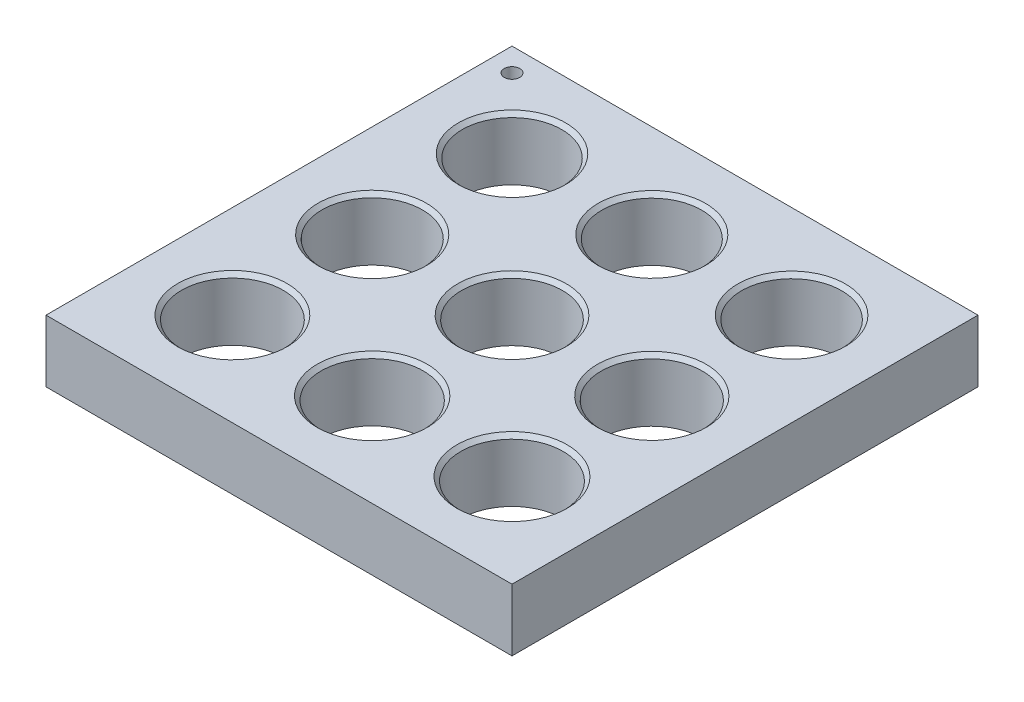
ISO-10303-21;
HEADER;
FILE_DESCRIPTION(('STEP AP214'),'2;1');
FILE_NAME('part.step','',(''),(''),'','','');
FILE_SCHEMA(('AUTOMOTIVE_DESIGN { 1 0 10303 214 1 1 1 1 }'));
ENDSEC;
DATA;
#1=APPLICATION_CONTEXT('core data for automotive mechanical design processes');
#2=APPLICATION_PROTOCOL_DEFINITION('international standard','automotive_design',2000,#1);
#3=PRODUCT_CONTEXT('',#1,'mechanical');
#4=PRODUCT('Part','Part','',(#3));
#5=PRODUCT_RELATED_PRODUCT_CATEGORY('part','',(#4));
#6=PRODUCT_DEFINITION_FORMATION('','',#4);
#7=PRODUCT_DEFINITION_CONTEXT('part definition',#1,'design');
#8=PRODUCT_DEFINITION('design','',#6,#7);
#9=PRODUCT_DEFINITION_SHAPE('','',#8);
#10=(LENGTH_UNIT() NAMED_UNIT(*) SI_UNIT(.MILLI.,.METRE.));
#11=(NAMED_UNIT(*) PLANE_ANGLE_UNIT() SI_UNIT($,.RADIAN.));
#12=(NAMED_UNIT(*) SI_UNIT($,.STERADIAN.) SOLID_ANGLE_UNIT());
#13=UNCERTAINTY_MEASURE_WITH_UNIT(LENGTH_MEASURE(1.E-05),#10,'distance_accuracy_value','');
#14=(GEOMETRIC_REPRESENTATION_CONTEXT(3) GLOBAL_UNCERTAINTY_ASSIGNED_CONTEXT((#13)) GLOBAL_UNIT_ASSIGNED_CONTEXT((#10,
#11,#12)) REPRESENTATION_CONTEXT('',''));
#15=CARTESIAN_POINT('',(0.,0.,0.));
#16=DIRECTION('',(0.,0.,1.));
#17=DIRECTION('',(1.,0.,0.));
#18=AXIS2_PLACEMENT_3D('',#15,#16,#17);
#19=CARTESIAN_POINT('',(30.,8.,-30.));
#20=DIRECTION('',(-1.,0.,0.));
#21=DIRECTION('',(0.,0.,1.));
#22=AXIS2_PLACEMENT_3D('',#19,#20,#21);
#23=PLANE('',#22);
#24=DIRECTION('',(0.,0.,-1.));
#25=VECTOR('',#24,1.);
#26=CARTESIAN_POINT('',(30.,0.,-30.));
#27=LINE('',#26,#25);
#28=CARTESIAN_POINT('',(30.,0.,30.));
#29=VERTEX_POINT('',#28);
#30=CARTESIAN_POINT('',(30.,0.,-30.));
#31=VERTEX_POINT('',#30);
#32=EDGE_CURVE('E122',#29,#31,#27,.T.);
#33=ORIENTED_EDGE('',*,*,#32,.T.);
#34=DIRECTION('',(0.,-1.,0.));
#35=VECTOR('',#34,1.);
#36=CARTESIAN_POINT('',(30.,8.,-30.));
#37=LINE('',#36,#35);
#38=CARTESIAN_POINT('',(30.,8.,-30.));
#39=VERTEX_POINT('',#38);
#40=EDGE_CURVE('E111',#39,#31,#37,.T.);
#41=ORIENTED_EDGE('',*,*,#40,.F.);
#42=DIRECTION('',(0.,0.,-1.));
#43=VECTOR('',#42,1.);
#44=CARTESIAN_POINT('',(30.,8.,-30.));
#45=LINE('',#44,#43);
#46=CARTESIAN_POINT('',(30.,8.,30.));
#47=VERTEX_POINT('',#46);
#48=EDGE_CURVE('E103',#47,#39,#45,.T.);
#49=ORIENTED_EDGE('',*,*,#48,.F.);
#50=DIRECTION('',(0.,-1.,0.));
#51=VECTOR('',#50,1.);
#52=CARTESIAN_POINT('',(30.,8.,30.));
#53=LINE('',#52,#51);
#54=EDGE_CURVE('E118',#47,#29,#53,.T.);
#55=ORIENTED_EDGE('',*,*,#54,.T.);
#56=EDGE_LOOP('',(#33,#41,#49,#55));
#57=FACE_BOUND('',#56,.T.);
#58=ADVANCED_FACE('F47',(#57),#23,.F.);
#59=CARTESIAN_POINT('',(-30.,8.,-30.));
#60=DIRECTION('',(0.,0.,1.));
#61=DIRECTION('',(1.,0.,0.));
#62=AXIS2_PLACEMENT_3D('',#59,#60,#61);
#63=PLANE('',#62);
#64=DIRECTION('',(-1.,0.,0.));
#65=VECTOR('',#64,1.);
#66=CARTESIAN_POINT('',(-30.,0.,-30.));
#67=LINE('',#66,#65);
#68=CARTESIAN_POINT('',(-30.,0.,-30.));
#69=VERTEX_POINT('',#68);
#70=EDGE_CURVE('E109',#31,#69,#67,.T.);
#71=ORIENTED_EDGE('',*,*,#70,.T.);
#72=DIRECTION('',(0.,-1.,0.));
#73=VECTOR('',#72,1.);
#74=CARTESIAN_POINT('',(-30.,8.,-30.));
#75=LINE('',#74,#73);
#76=CARTESIAN_POINT('',(-30.,8.,-30.));
#77=VERTEX_POINT('',#76);
#78=EDGE_CURVE('E107',#77,#69,#75,.T.);
#79=ORIENTED_EDGE('',*,*,#78,.F.);
#80=DIRECTION('',(-1.,0.,0.));
#81=VECTOR('',#80,1.);
#82=CARTESIAN_POINT('',(-30.,8.,-30.));
#83=LINE('',#82,#81);
#84=EDGE_CURVE('E98',#39,#77,#83,.T.);
#85=ORIENTED_EDGE('',*,*,#84,.F.);
#86=ORIENTED_EDGE('',*,*,#40,.T.);
#87=EDGE_LOOP('',(#71,#79,#85,#86));
#88=FACE_BOUND('',#87,.T.);
#89=ADVANCED_FACE('F108',(#88),#63,.F.);
#90=CARTESIAN_POINT('',(-30.,8.,-30.));
#91=DIRECTION('',(1.,0.,0.));
#92=DIRECTION('',(0.,0.,-1.));
#93=AXIS2_PLACEMENT_3D('',#90,#91,#92);
#94=PLANE('',#93);
#95=DIRECTION('',(0.,0.,1.));
#96=VECTOR('',#95,1.);
#97=CARTESIAN_POINT('',(-30.,0.,-30.));
#98=LINE('',#97,#96);
#99=CARTESIAN_POINT('',(-30.,0.,30.));
#100=VERTEX_POINT('',#99);
#101=EDGE_CURVE('E84',#69,#100,#98,.T.);
#102=ORIENTED_EDGE('',*,*,#101,.T.);
#103=DIRECTION('',(0.,-1.,0.));
#104=VECTOR('',#103,1.);
#105=CARTESIAN_POINT('',(-30.,8.,30.));
#106=LINE('',#105,#104);
#107=CARTESIAN_POINT('',(-30.,8.,30.));
#108=VERTEX_POINT('',#107);
#109=EDGE_CURVE('E112',#108,#100,#106,.T.);
#110=ORIENTED_EDGE('',*,*,#109,.F.);
#111=DIRECTION('',(0.,0.,1.));
#112=VECTOR('',#111,1.);
#113=CARTESIAN_POINT('',(-30.,8.,-30.));
#114=LINE('',#113,#112);
#115=EDGE_CURVE('E101',#77,#108,#114,.T.);
#116=ORIENTED_EDGE('',*,*,#115,.F.);
#117=ORIENTED_EDGE('',*,*,#78,.T.);
#118=EDGE_LOOP('',(#102,#110,#116,#117));
#119=FACE_BOUND('',#118,.T.);
#120=ADVANCED_FACE('F114',(#119),#94,.F.);
#121=CARTESIAN_POINT('',(-30.,8.,30.));
#122=DIRECTION('',(0.,0.,-1.));
#123=DIRECTION('',(-1.,0.,0.));
#124=AXIS2_PLACEMENT_3D('',#121,#122,#123);
#125=PLANE('',#124);
#126=DIRECTION('',(1.,0.,0.));
#127=VECTOR('',#126,1.);
#128=CARTESIAN_POINT('',(-30.,0.,30.));
#129=LINE('',#128,#127);
#130=EDGE_CURVE('E90',#100,#29,#129,.T.);
#131=ORIENTED_EDGE('',*,*,#130,.T.);
#132=ORIENTED_EDGE('',*,*,#54,.F.);
#133=DIRECTION('',(1.,0.,0.));
#134=VECTOR('',#133,1.);
#135=CARTESIAN_POINT('',(-30.,8.,30.));
#136=LINE('',#135,#134);
#137=EDGE_CURVE('E67',#108,#47,#136,.T.);
#138=ORIENTED_EDGE('',*,*,#137,.F.);
#139=ORIENTED_EDGE('',*,*,#109,.T.);
#140=EDGE_LOOP('',(#131,#132,#138,#139));
#141=FACE_BOUND('',#140,.T.);
#142=ADVANCED_FACE('F385',(#141),#125,.F.);
#143=CARTESIAN_POINT('',(0.,8.,0.));
#144=DIRECTION('',(0.,1.,0.));
#145=DIRECTION('',(0.,0.,1.));
#146=AXIS2_PLACEMENT_3D('',#143,#144,#145);
#147=PLANE('',#146);
#148=CARTESIAN_POINT('',(-27.,8.,-27.));
#149=DIRECTION('',(0.,1.,0.));
#150=DIRECTION('',(0.,0.,1.));
#151=AXIS2_PLACEMENT_3D('',#148,#149,#150);
#152=CIRCLE('',#151,1.);
#153=CARTESIAN_POINT('',(-27.,8.,-26.));
#154=VERTEX_POINT('',#153);
#155=EDGE_CURVE('E52',#154,#154,#152,.F.);
#156=ORIENTED_EDGE('',*,*,#155,.T.);
#157=EDGE_LOOP('',(#156));
#158=FACE_BOUND('',#157,.T.);
#159=CARTESIAN_POINT('',(18.,8.,18.));
#160=DIRECTION('',(0.,1.,0.));
#161=DIRECTION('',(0.,0.,1.));
#162=AXIS2_PLACEMENT_3D('',#159,#160,#161);
#163=CIRCLE('',#162,7.10000000000002);
#164=CARTESIAN_POINT('',(18.,8.,25.1));
#165=VERTEX_POINT('',#164);
#166=EDGE_CURVE('E175',#165,#165,#163,.F.);
#167=ORIENTED_EDGE('',*,*,#166,.T.);
#168=EDGE_LOOP('',(#167));
#169=FACE_BOUND('',#168,.T.);
#170=CARTESIAN_POINT('',(0.,8.,18.));
#171=DIRECTION('',(0.,1.,0.));
#172=DIRECTION('',(0.,0.,1.));
#173=AXIS2_PLACEMENT_3D('',#170,#171,#172);
#174=CIRCLE('',#173,7.075);
#175=CARTESIAN_POINT('',(0.,8.,25.075));
#176=VERTEX_POINT('',#175);
#177=EDGE_CURVE('E171',#176,#176,#174,.F.);
#178=ORIENTED_EDGE('',*,*,#177,.T.);
#179=EDGE_LOOP('',(#178));
#180=FACE_BOUND('',#179,.T.);
#181=CARTESIAN_POINT('',(-18.,8.,18.));
#182=DIRECTION('',(0.,1.,0.));
#183=DIRECTION('',(0.,0.,1.));
#184=AXIS2_PLACEMENT_3D('',#181,#182,#183);
#185=CIRCLE('',#184,7.05000000000002);
#186=CARTESIAN_POINT('',(-18.,8.,25.05));
#187=VERTEX_POINT('',#186);
#188=EDGE_CURVE('E167',#187,#187,#185,.F.);
#189=ORIENTED_EDGE('',*,*,#188,.T.);
#190=EDGE_LOOP('',(#189));
#191=FACE_BOUND('',#190,.T.);
#192=CARTESIAN_POINT('',(-18.,8.,0.));
#193=DIRECTION('',(0.,1.,0.));
#194=DIRECTION('',(0.,0.,1.));
#195=AXIS2_PLACEMENT_3D('',#192,#193,#194);
#196=CIRCLE('',#195,6.97500000000002);
#197=CARTESIAN_POINT('',(-18.,8.,6.97500000000002));
#198=VERTEX_POINT('',#197);
#199=EDGE_CURVE('E163',#198,#198,#196,.F.);
#200=ORIENTED_EDGE('',*,*,#199,.T.);
#201=EDGE_LOOP('',(#200));
#202=FACE_BOUND('',#201,.T.);
#203=CARTESIAN_POINT('',(18.,8.,0.));
#204=DIRECTION('',(0.,1.,0.));
#205=DIRECTION('',(0.,0.,1.));
#206=AXIS2_PLACEMENT_3D('',#203,#204,#205);
#207=CIRCLE('',#206,7.02500000000001);
#208=CARTESIAN_POINT('',(18.,8.,7.02500000000001));
#209=VERTEX_POINT('',#208);
#210=EDGE_CURVE('E159',#209,#209,#207,.F.);
#211=ORIENTED_EDGE('',*,*,#210,.T.);
#212=EDGE_LOOP('',(#211));
#213=FACE_BOUND('',#212,.T.);
#214=CARTESIAN_POINT('',(0.,8.,0.));
#215=DIRECTION('',(0.,1.,0.));
#216=DIRECTION('',(0.,0.,1.));
#217=AXIS2_PLACEMENT_3D('',#214,#215,#216);
#218=CIRCLE('',#217,7.);
#219=CARTESIAN_POINT('',(0.,8.,7.));
#220=VERTEX_POINT('',#219);
#221=EDGE_CURVE('E155',#220,#220,#218,.F.);
#222=ORIENTED_EDGE('',*,*,#221,.T.);
#223=EDGE_LOOP('',(#222));
#224=FACE_BOUND('',#223,.T.);
#225=CARTESIAN_POINT('',(18.,8.,-18.));
#226=DIRECTION('',(0.,1.,0.));
#227=DIRECTION('',(0.,0.,1.));
#228=AXIS2_PLACEMENT_3D('',#225,#226,#227);
#229=CIRCLE('',#228,6.95);
#230=CARTESIAN_POINT('',(18.,8.,-11.05));
#231=VERTEX_POINT('',#230);
#232=EDGE_CURVE('E151',#231,#231,#229,.F.);
#233=ORIENTED_EDGE('',*,*,#232,.T.);
#234=EDGE_LOOP('',(#233));
#235=FACE_BOUND('',#234,.T.);
#236=CARTESIAN_POINT('',(0.,8.,-18.));
#237=DIRECTION('',(0.,1.,0.));
#238=DIRECTION('',(0.,0.,1.));
#239=AXIS2_PLACEMENT_3D('',#236,#237,#238);
#240=CIRCLE('',#239,6.925);
#241=CARTESIAN_POINT('',(0.,8.,-11.075));
#242=VERTEX_POINT('',#241);
#243=EDGE_CURVE('E147',#242,#242,#240,.F.);
#244=ORIENTED_EDGE('',*,*,#243,.T.);
#245=EDGE_LOOP('',(#244));
#246=FACE_BOUND('',#245,.T.);
#247=CARTESIAN_POINT('',(-18.,8.,-18.));
#248=DIRECTION('',(0.,1.,0.));
#249=DIRECTION('',(0.,0.,1.));
#250=AXIS2_PLACEMENT_3D('',#247,#248,#249);
#251=CIRCLE('',#250,6.9);
#252=CARTESIAN_POINT('',(-18.,8.,-11.1));
#253=VERTEX_POINT('',#252);
#254=EDGE_CURVE('E143',#253,#253,#251,.F.);
#255=ORIENTED_EDGE('',*,*,#254,.T.);
#256=EDGE_LOOP('',(#255));
#257=FACE_BOUND('',#256,.T.);
#258=ORIENTED_EDGE('',*,*,#48,.T.);
#259=ORIENTED_EDGE('',*,*,#84,.T.);
#260=ORIENTED_EDGE('',*,*,#115,.T.);
#261=ORIENTED_EDGE('',*,*,#137,.T.);
#262=EDGE_LOOP('',(#258,#259,#260,#261));
#263=FACE_BOUND('',#262,.T.);
#264=ADVANCED_FACE('F99',(#158,#169,#180,#191,#202,#213,#224,#235,#246,#257,#263),#147,.T.);
#265=CARTESIAN_POINT('',(0.,0.,0.));
#266=DIRECTION('',(0.,1.,0.));
#267=DIRECTION('',(0.,0.,1.));
#268=AXIS2_PLACEMENT_3D('',#265,#266,#267);
#269=PLANE('',#268);
#270=CARTESIAN_POINT('',(0.,0.,-18.));
#271=DIRECTION('',(0.,1.,0.));
#272=DIRECTION('',(0.,0.,1.));
#273=AXIS2_PLACEMENT_3D('',#270,#271,#272);
#274=CIRCLE('',#273,6.425);
#275=CARTESIAN_POINT('',(0.,0.,-11.575));
#276=VERTEX_POINT('',#275);
#277=EDGE_CURVE('E313',#276,#276,#274,.T.);
#278=ORIENTED_EDGE('',*,*,#277,.T.);
#279=EDGE_LOOP('',(#278));
#280=FACE_BOUND('',#279,.T.);
#281=CARTESIAN_POINT('',(18.,0.,-18.));
#282=DIRECTION('',(0.,1.,0.));
#283=DIRECTION('',(0.,0.,1.));
#284=AXIS2_PLACEMENT_3D('',#281,#282,#283);
#285=CIRCLE('',#284,6.45);
#286=CARTESIAN_POINT('',(18.,0.,-11.55));
#287=VERTEX_POINT('',#286);
#288=EDGE_CURVE('E304',#287,#287,#285,.T.);
#289=ORIENTED_EDGE('',*,*,#288,.T.);
#290=EDGE_LOOP('',(#289));
#291=FACE_BOUND('',#290,.T.);
#292=CARTESIAN_POINT('',(-18.,0.,0.));
#293=DIRECTION('',(0.,1.,0.));
#294=DIRECTION('',(0.,0.,1.));
#295=AXIS2_PLACEMENT_3D('',#292,#293,#294);
#296=CIRCLE('',#295,6.475);
#297=CARTESIAN_POINT('',(-18.,0.,6.475));
#298=VERTEX_POINT('',#297);
#299=EDGE_CURVE('E298',#298,#298,#296,.T.);
#300=ORIENTED_EDGE('',*,*,#299,.T.);
#301=EDGE_LOOP('',(#300));
#302=FACE_BOUND('',#301,.T.);
#303=CARTESIAN_POINT('',(0.,0.,0.));
#304=DIRECTION('',(0.,1.,0.));
#305=DIRECTION('',(0.,0.,1.));
#306=AXIS2_PLACEMENT_3D('',#303,#304,#305);
#307=CIRCLE('',#306,6.5);
#308=CARTESIAN_POINT('',(0.,0.,6.5));
#309=VERTEX_POINT('',#308);
#310=EDGE_CURVE('E295',#309,#309,#307,.T.);
#311=ORIENTED_EDGE('',*,*,#310,.T.);
#312=EDGE_LOOP('',(#311));
#313=FACE_BOUND('',#312,.T.);
#314=CARTESIAN_POINT('',(-18.,0.,18.));
#315=DIRECTION('',(0.,1.,0.));
#316=DIRECTION('',(0.,0.,1.));
#317=AXIS2_PLACEMENT_3D('',#314,#315,#316);
#318=CIRCLE('',#317,6.55);
#319=CARTESIAN_POINT('',(-18.,0.,24.55));
#320=VERTEX_POINT('',#319);
#321=EDGE_CURVE('E327',#320,#320,#318,.T.);
#322=ORIENTED_EDGE('',*,*,#321,.T.);
#323=EDGE_LOOP('',(#322));
#324=FACE_BOUND('',#323,.T.);
#325=CARTESIAN_POINT('',(18.,0.,18.));
#326=DIRECTION('',(0.,1.,0.));
#327=DIRECTION('',(0.,0.,1.));
#328=AXIS2_PLACEMENT_3D('',#325,#326,#327);
#329=CIRCLE('',#328,6.60000000000001);
#330=CARTESIAN_POINT('',(18.,0.,24.6));
#331=VERTEX_POINT('',#330);
#332=EDGE_CURVE('E325',#331,#331,#329,.T.);
#333=ORIENTED_EDGE('',*,*,#332,.T.);
#334=EDGE_LOOP('',(#333));
#335=FACE_BOUND('',#334,.T.);
#336=CARTESIAN_POINT('',(0.,0.,18.));
#337=DIRECTION('',(0.,1.,0.));
#338=DIRECTION('',(0.,0.,1.));
#339=AXIS2_PLACEMENT_3D('',#336,#337,#338);
#340=CIRCLE('',#339,6.575);
#341=CARTESIAN_POINT('',(0.,0.,24.575));
#342=VERTEX_POINT('',#341);
#343=EDGE_CURVE('E307',#342,#342,#340,.T.);
#344=ORIENTED_EDGE('',*,*,#343,.T.);
#345=EDGE_LOOP('',(#344));
#346=FACE_BOUND('',#345,.T.);
#347=CARTESIAN_POINT('',(18.,0.,0.));
#348=DIRECTION('',(0.,1.,0.));
#349=DIRECTION('',(0.,0.,1.));
#350=AXIS2_PLACEMENT_3D('',#347,#348,#349);
#351=CIRCLE('',#350,6.525);
#352=CARTESIAN_POINT('',(18.,0.,6.525));
#353=VERTEX_POINT('',#352);
#354=EDGE_CURVE('E299',#353,#353,#351,.T.);
#355=ORIENTED_EDGE('',*,*,#354,.T.);
#356=EDGE_LOOP('',(#355));
#357=FACE_BOUND('',#356,.T.);
#358=CARTESIAN_POINT('',(-18.,0.,-18.));
#359=DIRECTION('',(0.,1.,0.));
#360=DIRECTION('',(0.,0.,1.));
#361=AXIS2_PLACEMENT_3D('',#358,#359,#360);
#362=CIRCLE('',#361,6.4);
#363=CARTESIAN_POINT('',(-18.,0.,-11.6));
#364=VERTEX_POINT('',#363);
#365=EDGE_CURVE('E126',#364,#364,#362,.T.);
#366=ORIENTED_EDGE('',*,*,#365,.T.);
#367=EDGE_LOOP('',(#366));
#368=FACE_BOUND('',#367,.T.);
#369=ORIENTED_EDGE('',*,*,#32,.F.);
#370=ORIENTED_EDGE('',*,*,#130,.F.);
#371=ORIENTED_EDGE('',*,*,#101,.F.);
#372=ORIENTED_EDGE('',*,*,#70,.F.);
#373=EDGE_LOOP('',(#369,#370,#371,#372));
#374=FACE_BOUND('',#373,.T.);
#375=ADVANCED_FACE('F382',(#280,#291,#302,#313,#324,#335,#346,#357,#368,#374),#269,.F.);
#376=CARTESIAN_POINT('',(-18.,0.,-18.));
#377=DIRECTION('',(0.,1.,0.));
#378=DIRECTION('',(0.,0.,1.));
#379=AXIS2_PLACEMENT_3D('',#376,#377,#378);
#380=CYLINDRICAL_SURFACE('',#379,6.4);
#381=CARTESIAN_POINT('',(-18.,7.49999999999999,-18.));
#382=DIRECTION('',(0.,1.,0.));
#383=DIRECTION('',(0.,0.,1.));
#384=AXIS2_PLACEMENT_3D('',#381,#382,#383);
#385=CIRCLE('',#384,6.4);
#386=CARTESIAN_POINT('',(-18.,7.49999999999999,-11.6));
#387=VERTEX_POINT('',#386);
#388=EDGE_CURVE('E11',#387,#387,#385,.T.);
#389=ORIENTED_EDGE('',*,*,#388,.T.);
#390=EDGE_LOOP('',(#389));
#391=FACE_BOUND('',#390,.T.);
#392=ORIENTED_EDGE('',*,*,#365,.F.);
#393=EDGE_LOOP('',(#392));
#394=FACE_BOUND('',#393,.T.);
#395=ADVANCED_FACE('F366',(#391,#394),#380,.F.);
#396=CARTESIAN_POINT('',(18.,0.,0.));
#397=DIRECTION('',(0.,1.,0.));
#398=DIRECTION('',(0.,0.,1.));
#399=AXIS2_PLACEMENT_3D('',#396,#397,#398);
#400=CYLINDRICAL_SURFACE('',#399,6.525);
#401=CARTESIAN_POINT('',(18.,7.49999999999999,0.));
#402=DIRECTION('',(0.,1.,0.));
#403=DIRECTION('',(0.,0.,1.));
#404=AXIS2_PLACEMENT_3D('',#401,#402,#403);
#405=CIRCLE('',#404,6.525);
#406=CARTESIAN_POINT('',(18.,7.49999999999999,6.525));
#407=VERTEX_POINT('',#406);
#408=EDGE_CURVE('E191',#407,#407,#405,.T.);
#409=ORIENTED_EDGE('',*,*,#408,.T.);
#410=EDGE_LOOP('',(#409));
#411=FACE_BOUND('',#410,.T.);
#412=ORIENTED_EDGE('',*,*,#354,.F.);
#413=EDGE_LOOP('',(#412));
#414=FACE_BOUND('',#413,.T.);
#415=ADVANCED_FACE('F363',(#411,#414),#400,.F.);
#416=CARTESIAN_POINT('',(0.,0.,18.));
#417=DIRECTION('',(0.,1.,0.));
#418=DIRECTION('',(0.,0.,1.));
#419=AXIS2_PLACEMENT_3D('',#416,#417,#418);
#420=CYLINDRICAL_SURFACE('',#419,6.575);
#421=CARTESIAN_POINT('',(0.,7.5,18.));
#422=DIRECTION('',(0.,1.,0.));
#423=DIRECTION('',(0.,0.,1.));
#424=AXIS2_PLACEMENT_3D('',#421,#422,#423);
#425=CIRCLE('',#424,6.575);
#426=CARTESIAN_POINT('',(0.,7.5,24.575));
#427=VERTEX_POINT('',#426);
#428=EDGE_CURVE('E179',#427,#427,#425,.T.);
#429=ORIENTED_EDGE('',*,*,#428,.T.);
#430=EDGE_LOOP('',(#429));
#431=FACE_BOUND('',#430,.T.);
#432=ORIENTED_EDGE('',*,*,#343,.F.);
#433=EDGE_LOOP('',(#432));
#434=FACE_BOUND('',#433,.T.);
#435=ADVANCED_FACE('F358',(#431,#434),#420,.F.);
#436=CARTESIAN_POINT('',(18.,0.,18.));
#437=DIRECTION('',(0.,1.,0.));
#438=DIRECTION('',(0.,0.,1.));
#439=AXIS2_PLACEMENT_3D('',#436,#437,#438);
#440=CYLINDRICAL_SURFACE('',#439,6.60000000000001);
#441=CARTESIAN_POINT('',(18.,7.49999999999998,18.));
#442=DIRECTION('',(0.,1.,0.));
#443=DIRECTION('',(0.,0.,1.));
#444=AXIS2_PLACEMENT_3D('',#441,#442,#443);
#445=CIRCLE('',#444,6.60000000000001);
#446=CARTESIAN_POINT('',(18.,7.49999999999998,24.6));
#447=VERTEX_POINT('',#446);
#448=EDGE_CURVE('E139',#447,#447,#445,.T.);
#449=ORIENTED_EDGE('',*,*,#448,.T.);
#450=EDGE_LOOP('',(#449));
#451=FACE_BOUND('',#450,.T.);
#452=ORIENTED_EDGE('',*,*,#332,.F.);
#453=EDGE_LOOP('',(#452));
#454=FACE_BOUND('',#453,.T.);
#455=ADVANCED_FACE('F355',(#451,#454),#440,.F.);
#456=CARTESIAN_POINT('',(-18.,0.,18.));
#457=DIRECTION('',(0.,1.,0.));
#458=DIRECTION('',(0.,0.,1.));
#459=AXIS2_PLACEMENT_3D('',#456,#457,#458);
#460=CYLINDRICAL_SURFACE('',#459,6.55);
#461=CARTESIAN_POINT('',(-18.,7.49999999999997,18.));
#462=DIRECTION('',(0.,1.,0.));
#463=DIRECTION('',(0.,0.,1.));
#464=AXIS2_PLACEMENT_3D('',#461,#462,#463);
#465=CIRCLE('',#464,6.55);
#466=CARTESIAN_POINT('',(-18.,7.49999999999997,24.55));
#467=VERTEX_POINT('',#466);
#468=EDGE_CURVE('E183',#467,#467,#465,.T.);
#469=ORIENTED_EDGE('',*,*,#468,.T.);
#470=EDGE_LOOP('',(#469));
#471=FACE_BOUND('',#470,.T.);
#472=ORIENTED_EDGE('',*,*,#321,.F.);
#473=EDGE_LOOP('',(#472));
#474=FACE_BOUND('',#473,.T.);
#475=ADVANCED_FACE('F291',(#471,#474),#460,.F.);
#476=CARTESIAN_POINT('',(0.,0.,0.));
#477=DIRECTION('',(0.,1.,0.));
#478=DIRECTION('',(0.,0.,1.));
#479=AXIS2_PLACEMENT_3D('',#476,#477,#478);
#480=CYLINDRICAL_SURFACE('',#479,6.5);
#481=CARTESIAN_POINT('',(0.,7.50000000000001,0.));
#482=DIRECTION('',(0.,1.,0.));
#483=DIRECTION('',(0.,0.,1.));
#484=AXIS2_PLACEMENT_3D('',#481,#482,#483);
#485=CIRCLE('',#484,6.5);
#486=CARTESIAN_POINT('',(0.,7.50000000000001,6.5));
#487=VERTEX_POINT('',#486);
#488=EDGE_CURVE('E195',#487,#487,#485,.T.);
#489=ORIENTED_EDGE('',*,*,#488,.T.);
#490=EDGE_LOOP('',(#489));
#491=FACE_BOUND('',#490,.T.);
#492=ORIENTED_EDGE('',*,*,#310,.F.);
#493=EDGE_LOOP('',(#492));
#494=FACE_BOUND('',#493,.T.);
#495=ADVANCED_FACE('F287',(#491,#494),#480,.F.);
#496=CARTESIAN_POINT('',(-18.,0.,0.));
#497=DIRECTION('',(0.,1.,0.));
#498=DIRECTION('',(0.,0.,1.));
#499=AXIS2_PLACEMENT_3D('',#496,#497,#498);
#500=CYLINDRICAL_SURFACE('',#499,6.475);
#501=CARTESIAN_POINT('',(-18.,7.49999999999999,0.));
#502=DIRECTION('',(0.,1.,0.));
#503=DIRECTION('',(0.,0.,1.));
#504=AXIS2_PLACEMENT_3D('',#501,#502,#503);
#505=CIRCLE('',#504,6.475);
#506=CARTESIAN_POINT('',(-18.,7.49999999999999,6.475));
#507=VERTEX_POINT('',#506);
#508=EDGE_CURVE('E187',#507,#507,#505,.T.);
#509=ORIENTED_EDGE('',*,*,#508,.T.);
#510=EDGE_LOOP('',(#509));
#511=FACE_BOUND('',#510,.T.);
#512=ORIENTED_EDGE('',*,*,#299,.F.);
#513=EDGE_LOOP('',(#512));
#514=FACE_BOUND('',#513,.T.);
#515=ADVANCED_FACE('F290',(#511,#514),#500,.F.);
#516=CARTESIAN_POINT('',(18.,0.,-18.));
#517=DIRECTION('',(0.,1.,0.));
#518=DIRECTION('',(0.,0.,1.));
#519=AXIS2_PLACEMENT_3D('',#516,#517,#518);
#520=CYLINDRICAL_SURFACE('',#519,6.45);
#521=CARTESIAN_POINT('',(18.,7.5,-18.));
#522=DIRECTION('',(0.,1.,0.));
#523=DIRECTION('',(0.,0.,1.));
#524=AXIS2_PLACEMENT_3D('',#521,#522,#523);
#525=CIRCLE('',#524,6.45);
#526=CARTESIAN_POINT('',(18.,7.5,-11.55));
#527=VERTEX_POINT('',#526);
#528=EDGE_CURVE('E199',#527,#527,#525,.T.);
#529=ORIENTED_EDGE('',*,*,#528,.T.);
#530=EDGE_LOOP('',(#529));
#531=FACE_BOUND('',#530,.T.);
#532=ORIENTED_EDGE('',*,*,#288,.F.);
#533=EDGE_LOOP('',(#532));
#534=FACE_BOUND('',#533,.T.);
#535=ADVANCED_FACE('F373',(#531,#534),#520,.F.);
#536=CARTESIAN_POINT('',(0.,0.,-18.));
#537=DIRECTION('',(0.,1.,0.));
#538=DIRECTION('',(0.,0.,1.));
#539=AXIS2_PLACEMENT_3D('',#536,#537,#538);
#540=CYLINDRICAL_SURFACE('',#539,6.425);
#541=CARTESIAN_POINT('',(0.,7.5,-18.));
#542=DIRECTION('',(0.,1.,0.));
#543=DIRECTION('',(0.,0.,1.));
#544=AXIS2_PLACEMENT_3D('',#541,#542,#543);
#545=CIRCLE('',#544,6.425);
#546=CARTESIAN_POINT('',(0.,7.5,-11.575));
#547=VERTEX_POINT('',#546);
#548=EDGE_CURVE('E59',#547,#547,#545,.T.);
#549=ORIENTED_EDGE('',*,*,#548,.T.);
#550=EDGE_LOOP('',(#549));
#551=FACE_BOUND('',#550,.T.);
#552=ORIENTED_EDGE('',*,*,#277,.F.);
#553=EDGE_LOOP('',(#552));
#554=FACE_BOUND('',#553,.T.);
#555=ADVANCED_FACE('F207',(#551,#554),#540,.F.);
#556=CARTESIAN_POINT('',(18.,7.49999999999998,18.));
#557=DIRECTION('',(0.,1.,0.));
#558=DIRECTION('',(0.,0.,1.));
#559=AXIS2_PLACEMENT_3D('',#556,#557,#558);
#560=CONICAL_SURFACE('',#559,6.60000000000001,0.78539816339744);
#561=ORIENTED_EDGE('',*,*,#166,.F.);
#562=EDGE_LOOP('',(#561));
#563=FACE_BOUND('',#562,.T.);
#564=ORIENTED_EDGE('',*,*,#448,.F.);
#565=EDGE_LOOP('',(#564));
#566=FACE_BOUND('',#565,.T.);
#567=ADVANCED_FACE('F235',(#563,#566),#560,.F.);
#568=CARTESIAN_POINT('',(0.,7.5,18.));
#569=DIRECTION('',(0.,1.,0.));
#570=DIRECTION('',(0.,0.,1.));
#571=AXIS2_PLACEMENT_3D('',#568,#569,#570);
#572=CONICAL_SURFACE('',#571,6.575,0.785398163397453);
#573=ORIENTED_EDGE('',*,*,#177,.F.);
#574=EDGE_LOOP('',(#573));
#575=FACE_BOUND('',#574,.T.);
#576=ORIENTED_EDGE('',*,*,#428,.F.);
#577=EDGE_LOOP('',(#576));
#578=FACE_BOUND('',#577,.T.);
#579=ADVANCED_FACE('F241',(#575,#578),#572,.F.);
#580=CARTESIAN_POINT('',(-18.,7.49999999999997,18.));
#581=DIRECTION('',(0.,1.,0.));
#582=DIRECTION('',(0.,0.,1.));
#583=AXIS2_PLACEMENT_3D('',#580,#581,#582);
#584=CONICAL_SURFACE('',#583,6.55,0.78539816339744);
#585=ORIENTED_EDGE('',*,*,#188,.F.);
#586=EDGE_LOOP('',(#585));
#587=FACE_BOUND('',#586,.T.);
#588=ORIENTED_EDGE('',*,*,#468,.F.);
#589=EDGE_LOOP('',(#588));
#590=FACE_BOUND('',#589,.T.);
#591=ADVANCED_FACE('F248',(#587,#590),#584,.F.);
#592=CARTESIAN_POINT('',(-18.,7.49999999999999,0.));
#593=DIRECTION('',(0.,1.,0.));
#594=DIRECTION('',(0.,0.,1.));
#595=AXIS2_PLACEMENT_3D('',#592,#593,#594);
#596=CONICAL_SURFACE('',#595,6.475,0.785398163397454);
#597=ORIENTED_EDGE('',*,*,#199,.F.);
#598=EDGE_LOOP('',(#597));
#599=FACE_BOUND('',#598,.T.);
#600=ORIENTED_EDGE('',*,*,#508,.F.);
#601=EDGE_LOOP('',(#600));
#602=FACE_BOUND('',#601,.T.);
#603=ADVANCED_FACE('F255',(#599,#602),#596,.F.);
#604=CARTESIAN_POINT('',(18.,7.49999999999999,0.));
#605=DIRECTION('',(0.,1.,0.));
#606=DIRECTION('',(0.,0.,1.));
#607=AXIS2_PLACEMENT_3D('',#604,#605,#606);
#608=CONICAL_SURFACE('',#607,6.525,0.785398163397453);
#609=ORIENTED_EDGE('',*,*,#210,.F.);
#610=EDGE_LOOP('',(#609));
#611=FACE_BOUND('',#610,.T.);
#612=ORIENTED_EDGE('',*,*,#408,.F.);
#613=EDGE_LOOP('',(#612));
#614=FACE_BOUND('',#613,.T.);
#615=ADVANCED_FACE('F262',(#611,#614),#608,.F.);
#616=CARTESIAN_POINT('',(0.,7.50000000000001,0.));
#617=DIRECTION('',(0.,1.,0.));
#618=DIRECTION('',(0.,0.,1.));
#619=AXIS2_PLACEMENT_3D('',#616,#617,#618);
#620=CONICAL_SURFACE('',#619,6.5,0.785398163397454);
#621=ORIENTED_EDGE('',*,*,#221,.F.);
#622=EDGE_LOOP('',(#621));
#623=FACE_BOUND('',#622,.T.);
#624=ORIENTED_EDGE('',*,*,#488,.F.);
#625=EDGE_LOOP('',(#624));
#626=FACE_BOUND('',#625,.T.);
#627=ADVANCED_FACE('F220',(#623,#626),#620,.F.);
#628=CARTESIAN_POINT('',(18.,7.5,-18.));
#629=DIRECTION('',(0.,1.,0.));
#630=DIRECTION('',(0.,0.,1.));
#631=AXIS2_PLACEMENT_3D('',#628,#629,#630);
#632=CONICAL_SURFACE('',#631,6.45,0.785398163397453);
#633=ORIENTED_EDGE('',*,*,#232,.F.);
#634=EDGE_LOOP('',(#633));
#635=FACE_BOUND('',#634,.T.);
#636=ORIENTED_EDGE('',*,*,#528,.F.);
#637=EDGE_LOOP('',(#636));
#638=FACE_BOUND('',#637,.T.);
#639=ADVANCED_FACE('F212',(#635,#638),#632,.F.);
#640=CARTESIAN_POINT('',(0.,7.5,-18.));
#641=DIRECTION('',(0.,1.,0.));
#642=DIRECTION('',(0.,0.,1.));
#643=AXIS2_PLACEMENT_3D('',#640,#641,#642);
#644=CONICAL_SURFACE('',#643,6.425,0.785398163397446);
#645=ORIENTED_EDGE('',*,*,#243,.F.);
#646=EDGE_LOOP('',(#645));
#647=FACE_BOUND('',#646,.T.);
#648=ORIENTED_EDGE('',*,*,#548,.F.);
#649=EDGE_LOOP('',(#648));
#650=FACE_BOUND('',#649,.T.);
#651=ADVANCED_FACE('F210',(#647,#650),#644,.F.);
#652=CARTESIAN_POINT('',(-18.,7.49999999999999,-18.));
#653=DIRECTION('',(0.,1.,0.));
#654=DIRECTION('',(0.,0.,1.));
#655=AXIS2_PLACEMENT_3D('',#652,#653,#654);
#656=CONICAL_SURFACE('',#655,6.4,0.785398163397446);
#657=ORIENTED_EDGE('',*,*,#254,.F.);
#658=EDGE_LOOP('',(#657));
#659=FACE_BOUND('',#658,.T.);
#660=ORIENTED_EDGE('',*,*,#388,.F.);
#661=EDGE_LOOP('',(#660));
#662=FACE_BOUND('',#661,.T.);
#663=ADVANCED_FACE('F50',(#659,#662),#656,.F.);
#664=CARTESIAN_POINT('',(-27.,8.000012,-27.));
#665=DIRECTION('',(0.,-1.,0.));
#666=DIRECTION('',(0.,0.,-1.));
#667=AXIS2_PLACEMENT_3D('',#664,#665,#666);
#668=CYLINDRICAL_SURFACE('',#667,1.);
#669=ORIENTED_EDGE('',*,*,#155,.F.);
#670=EDGE_LOOP('',(#669));
#671=FACE_BOUND('',#670,.T.);
#672=CARTESIAN_POINT('',(-27.,6.,-27.));
#673=DIRECTION('',(0.,1.,0.));
#674=DIRECTION('',(0.,0.,1.));
#675=AXIS2_PLACEMENT_3D('',#672,#673,#674);
#676=CIRCLE('',#675,1.);
#677=CARTESIAN_POINT('',(-27.,6.,-26.));
#678=VERTEX_POINT('',#677);
#679=EDGE_CURVE('E334',#678,#678,#676,.T.);
#680=ORIENTED_EDGE('',*,*,#679,.F.);
#681=EDGE_LOOP('',(#680));
#682=FACE_BOUND('',#681,.T.);
#683=ADVANCED_FACE('F218',(#671,#682),#668,.F.);
#684=CARTESIAN_POINT('',(-27.,6.,-27.));
#685=DIRECTION('',(0.,1.,0.));
#686=DIRECTION('',(0.,0.,1.));
#687=AXIS2_PLACEMENT_3D('',#684,#685,#686);
#688=PLANE('',#687);
#689=ORIENTED_EDGE('',*,*,#679,.T.);
#690=EDGE_LOOP('',(#689));
#691=FACE_BOUND('',#690,.T.);
#692=ADVANCED_FACE('F347',(#691),#688,.T.);
#693=CLOSED_SHELL('',(#58,#89,#120,#142,#264,#375,#395,#415,#435,#455,#475,#495,#515,#535,#555,
#567,#579,#591,#603,#615,#627,#639,#651,#663,#683,#692));
#694=MANIFOLD_SOLID_BREP('B2',#693);
#695=ADVANCED_BREP_SHAPE_REPRESENTATION('',(#18,#694),#14);
#696=SHAPE_DEFINITION_REPRESENTATION(#9,#695);
ENDSEC;
END-ISO-10303-21;
